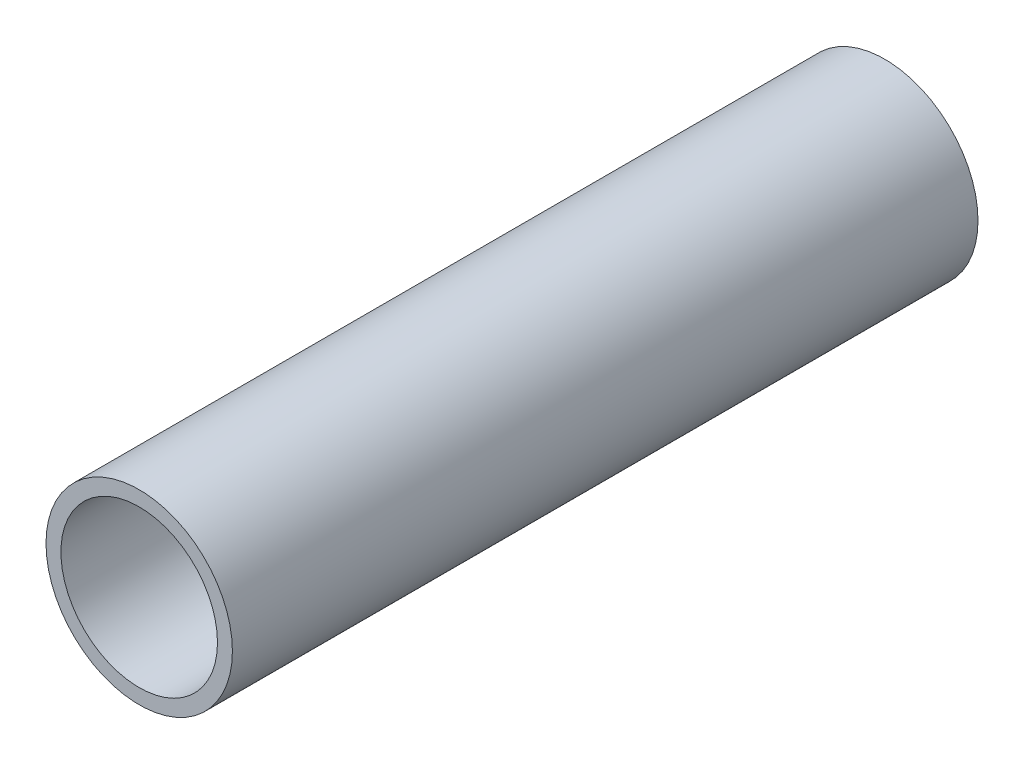
ISO-10303-21;
HEADER;
FILE_DESCRIPTION(('STEP AP214'),'2;1');
FILE_NAME('part.step','',(''),(''),'','','');
FILE_SCHEMA(('AUTOMOTIVE_DESIGN { 1 0 10303 214 1 1 1 1 }'));
ENDSEC;
DATA;
#1=APPLICATION_CONTEXT('core data for automotive mechanical design processes');
#2=APPLICATION_PROTOCOL_DEFINITION('international standard','automotive_design',2000,#1);
#3=PRODUCT_CONTEXT('',#1,'mechanical');
#4=PRODUCT('Part','Part','',(#3));
#5=PRODUCT_RELATED_PRODUCT_CATEGORY('part','',(#4));
#6=PRODUCT_DEFINITION_FORMATION('','',#4);
#7=PRODUCT_DEFINITION_CONTEXT('part definition',#1,'design');
#8=PRODUCT_DEFINITION('design','',#6,#7);
#9=PRODUCT_DEFINITION_SHAPE('','',#8);
#10=(LENGTH_UNIT() NAMED_UNIT(*) SI_UNIT(.MILLI.,.METRE.));
#11=(NAMED_UNIT(*) PLANE_ANGLE_UNIT() SI_UNIT($,.RADIAN.));
#12=(NAMED_UNIT(*) SI_UNIT($,.STERADIAN.) SOLID_ANGLE_UNIT());
#13=UNCERTAINTY_MEASURE_WITH_UNIT(LENGTH_MEASURE(1.E-05),#10,'distance_accuracy_value','');
#14=(GEOMETRIC_REPRESENTATION_CONTEXT(3) GLOBAL_UNCERTAINTY_ASSIGNED_CONTEXT((#13)) GLOBAL_UNIT_ASSIGNED_CONTEXT((#10,
#11,#12)) REPRESENTATION_CONTEXT('',''));
#15=CARTESIAN_POINT('',(0.,0.,0.));
#16=DIRECTION('',(0.,0.,1.));
#17=DIRECTION('',(1.,0.,0.));
#18=AXIS2_PLACEMENT_3D('',#15,#16,#17);
#19=CARTESIAN_POINT('',(0.,0.,25.));
#20=DIRECTION('',(0.,0.,1.));
#21=DIRECTION('',(1.,0.,0.));
#22=AXIS2_PLACEMENT_3D('',#19,#20,#21);
#23=PLANE('',#22);
#24=CARTESIAN_POINT('',(0.,0.,25.));
#25=DIRECTION('',(0.,0.,1.));
#26=DIRECTION('',(1.,0.,0.));
#27=AXIS2_PLACEMENT_3D('',#24,#25,#26);
#28=CIRCLE('',#27,6.25);
#29=CARTESIAN_POINT('',(6.25,0.,25.));
#30=VERTEX_POINT('',#29);
#31=EDGE_CURVE('E10',#30,#30,#28,.T.);
#32=ORIENTED_EDGE('',*,*,#31,.T.);
#33=EDGE_LOOP('',(#32));
#34=FACE_BOUND('',#33,.T.);
#35=CARTESIAN_POINT('',(0.,0.,25.));
#36=DIRECTION('',(0.,0.,1.));
#37=DIRECTION('',(1.,0.,0.));
#38=AXIS2_PLACEMENT_3D('',#35,#36,#37);
#39=CIRCLE('',#38,5.25);
#40=CARTESIAN_POINT('',(5.25,0.,25.));
#41=VERTEX_POINT('',#40);
#42=EDGE_CURVE('E50',#41,#41,#39,.T.);
#43=ORIENTED_EDGE('',*,*,#42,.F.);
#44=EDGE_LOOP('',(#43));
#45=FACE_BOUND('',#44,.T.);
#46=ADVANCED_FACE('F37',(#34,#45),#23,.T.);
#47=CARTESIAN_POINT('',(0.,0.,-25.));
#48=DIRECTION('',(0.,0.,1.));
#49=DIRECTION('',(1.,0.,0.));
#50=AXIS2_PLACEMENT_3D('',#47,#48,#49);
#51=PLANE('',#50);
#52=CARTESIAN_POINT('',(0.,0.,-25.));
#53=DIRECTION('',(0.,0.,1.));
#54=DIRECTION('',(1.,0.,0.));
#55=AXIS2_PLACEMENT_3D('',#52,#53,#54);
#56=CIRCLE('',#55,6.25);
#57=CARTESIAN_POINT('',(6.25,0.,-25.));
#58=VERTEX_POINT('',#57);
#59=EDGE_CURVE('E41',#58,#58,#56,.T.);
#60=ORIENTED_EDGE('',*,*,#59,.F.);
#61=EDGE_LOOP('',(#60));
#62=FACE_BOUND('',#61,.T.);
#63=CARTESIAN_POINT('',(0.,0.,-25.));
#64=DIRECTION('',(0.,0.,1.));
#65=DIRECTION('',(1.,0.,0.));
#66=AXIS2_PLACEMENT_3D('',#63,#64,#65);
#67=CIRCLE('',#66,5.25);
#68=CARTESIAN_POINT('',(5.25,0.,-25.));
#69=VERTEX_POINT('',#68);
#70=EDGE_CURVE('E52',#69,#69,#67,.T.);
#71=ORIENTED_EDGE('',*,*,#70,.T.);
#72=EDGE_LOOP('',(#71));
#73=FACE_BOUND('',#72,.T.);
#74=ADVANCED_FACE('F64',(#62,#73),#51,.F.);
#75=CARTESIAN_POINT('',(0.,0.,25.));
#76=DIRECTION('',(0.,0.,-1.));
#77=DIRECTION('',(-1.,0.,0.));
#78=AXIS2_PLACEMENT_3D('',#75,#76,#77);
#79=CYLINDRICAL_SURFACE('',#78,6.25);
#80=ORIENTED_EDGE('',*,*,#31,.F.);
#81=EDGE_LOOP('',(#80));
#82=FACE_BOUND('',#81,.T.);
#83=ORIENTED_EDGE('',*,*,#59,.T.);
#84=EDGE_LOOP('',(#83));
#85=FACE_BOUND('',#84,.T.);
#86=ADVANCED_FACE('F39',(#82,#85),#79,.T.);
#87=CARTESIAN_POINT('',(0.,0.,25.));
#88=DIRECTION('',(0.,0.,-1.));
#89=DIRECTION('',(-1.,0.,0.));
#90=AXIS2_PLACEMENT_3D('',#87,#88,#89);
#91=CYLINDRICAL_SURFACE('',#90,5.25);
#92=ORIENTED_EDGE('',*,*,#42,.T.);
#93=EDGE_LOOP('',(#92));
#94=FACE_BOUND('',#93,.T.);
#95=ORIENTED_EDGE('',*,*,#70,.F.);
#96=EDGE_LOOP('',(#95));
#97=FACE_BOUND('',#96,.T.);
#98=ADVANCED_FACE('F60',(#94,#97),#91,.F.);
#99=CLOSED_SHELL('',(#46,#74,#86,#98));
#100=MANIFOLD_SOLID_BREP('B2',#99);
#101=ADVANCED_BREP_SHAPE_REPRESENTATION('',(#18,#100),#14);
#102=SHAPE_DEFINITION_REPRESENTATION(#9,#101);
ENDSEC;
END-ISO-10303-21;
